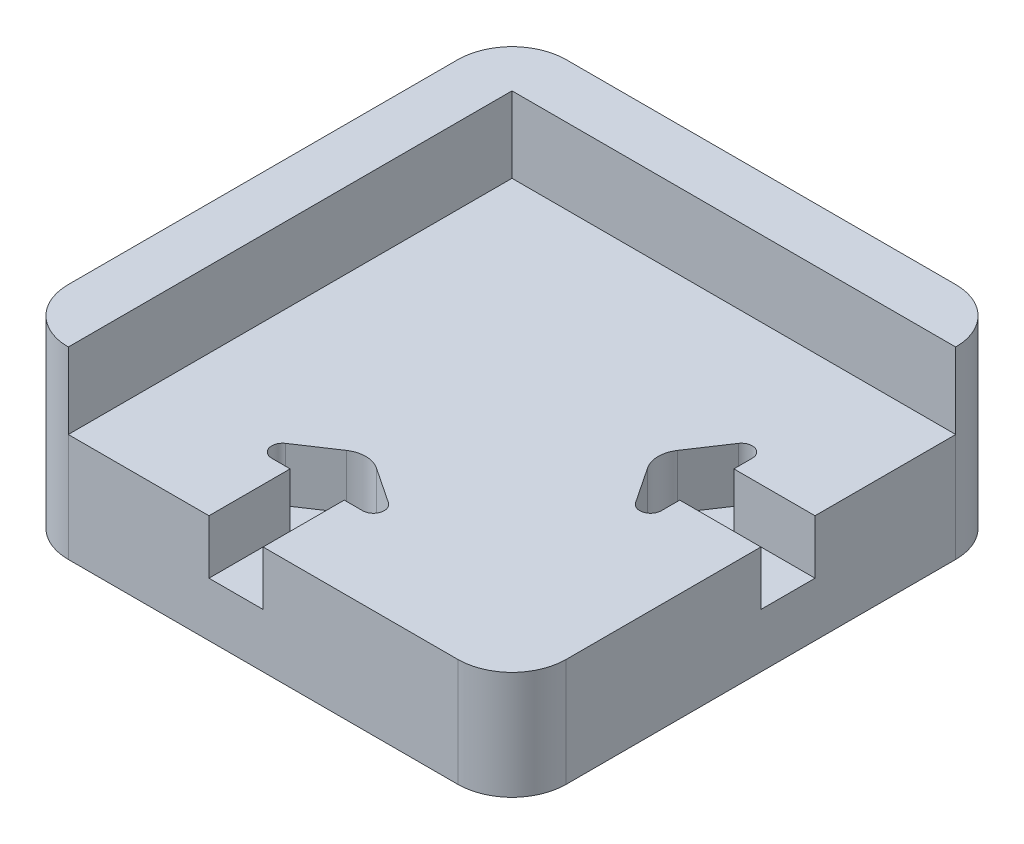
ISO-10303-21;
HEADER;
FILE_DESCRIPTION(('STEP AP214'),'2;1');
FILE_NAME('part.step','',(''),(''),'','','');
FILE_SCHEMA(('AUTOMOTIVE_DESIGN { 1 0 10303 214 1 1 1 1 }'));
ENDSEC;
DATA;
#1=APPLICATION_CONTEXT('core data for automotive mechanical design processes');
#2=APPLICATION_PROTOCOL_DEFINITION('international standard','automotive_design',2000,#1);
#3=PRODUCT_CONTEXT('',#1,'mechanical');
#4=PRODUCT('Part','Part','',(#3));
#5=PRODUCT_RELATED_PRODUCT_CATEGORY('part','',(#4));
#6=PRODUCT_DEFINITION_FORMATION('','',#4);
#7=PRODUCT_DEFINITION_CONTEXT('part definition',#1,'design');
#8=PRODUCT_DEFINITION('design','',#6,#7);
#9=PRODUCT_DEFINITION_SHAPE('','',#8);
#10=(LENGTH_UNIT() NAMED_UNIT(*) SI_UNIT(.MILLI.,.METRE.));
#11=(NAMED_UNIT(*) PLANE_ANGLE_UNIT() SI_UNIT($,.RADIAN.));
#12=(NAMED_UNIT(*) SI_UNIT($,.STERADIAN.) SOLID_ANGLE_UNIT());
#13=UNCERTAINTY_MEASURE_WITH_UNIT(LENGTH_MEASURE(1.E-05),#10,'distance_accuracy_value','');
#14=(GEOMETRIC_REPRESENTATION_CONTEXT(3) GLOBAL_UNCERTAINTY_ASSIGNED_CONTEXT((#13)) GLOBAL_UNIT_ASSIGNED_CONTEXT((#10,
#11,#12)) REPRESENTATION_CONTEXT('',''));
#15=CARTESIAN_POINT('',(0.,0.,0.));
#16=DIRECTION('',(0.,0.,1.));
#17=DIRECTION('',(1.,0.,0.));
#18=AXIS2_PLACEMENT_3D('',#15,#16,#17);
#19=CARTESIAN_POINT('',(56.5334750265675,20.,0.));
#20=DIRECTION('',(1.,0.,0.));
#21=DIRECTION('',(0.,0.,-1.));
#22=AXIS2_PLACEMENT_3D('',#19,#20,#21);
#23=PLANE('',#22);
#24=DIRECTION('',(0.,1.,0.));
#25=VECTOR('',#24,1.);
#26=CARTESIAN_POINT('',(56.5334750265675,10.,16.0010626992561));
#27=LINE('',#26,#25);
#28=CARTESIAN_POINT('',(56.5334750265675,10.,16.0010626992561));
#29=VERTEX_POINT('',#28);
#30=CARTESIAN_POINT('',(56.5334750265675,20.,16.0010626992561));
#31=VERTEX_POINT('',#30);
#32=EDGE_CURVE('E291',#29,#31,#27,.T.);
#33=ORIENTED_EDGE('',*,*,#32,.F.);
#34=DIRECTION('',(0.,0.,-1.));
#35=VECTOR('',#34,1.);
#36=CARTESIAN_POINT('',(56.5334750265675,10.,0.));
#37=LINE('',#36,#35);
#38=CARTESIAN_POINT('',(56.5334750265675,10.,26.0010626992561));
#39=VERTEX_POINT('',#38);
#40=EDGE_CURVE('E246',#39,#29,#37,.T.);
#41=ORIENTED_EDGE('',*,*,#40,.F.);
#42=DIRECTION('',(0.,1.,0.));
#43=VECTOR('',#42,1.);
#44=CARTESIAN_POINT('',(56.5334750265675,10.,26.0010626992561));
#45=LINE('',#44,#43);
#46=CARTESIAN_POINT('',(56.5334750265675,20.,26.0010626992561));
#47=VERTEX_POINT('',#46);
#48=EDGE_CURVE('E241',#39,#47,#45,.T.);
#49=ORIENTED_EDGE('',*,*,#48,.T.);
#50=DIRECTION('',(0.,0.,1.));
#51=VECTOR('',#50,1.);
#52=CARTESIAN_POINT('',(56.5334750265675,20.,0.));
#53=LINE('',#52,#51);
#54=CARTESIAN_POINT('',(56.5334750265675,20.,62.0010626992561));
#55=VERTEX_POINT('',#54);
#56=EDGE_CURVE('E366',#47,#55,#53,.T.);
#57=ORIENTED_EDGE('',*,*,#56,.T.);
#58=DIRECTION('',(0.,-1.,0.));
#59=VECTOR('',#58,1.);
#60=CARTESIAN_POINT('',(56.5334750265675,0.,62.0010626992561));
#61=LINE('',#60,#59);
#62=CARTESIAN_POINT('',(56.5334750265675,0.,62.0010626992561));
#63=VERTEX_POINT('',#62);
#64=EDGE_CURVE('E394',#55,#63,#61,.T.);
#65=ORIENTED_EDGE('',*,*,#64,.T.);
#66=DIRECTION('',(0.,0.,1.));
#67=VECTOR('',#66,1.);
#68=CARTESIAN_POINT('',(56.5334750265675,0.,0.));
#69=LINE('',#68,#67);
#70=CARTESIAN_POINT('',(56.5334750265675,0.,-9.99893730074389));
#71=VERTEX_POINT('',#70);
#72=EDGE_CURVE('E361',#71,#63,#69,.T.);
#73=ORIENTED_EDGE('',*,*,#72,.F.);
#74=DIRECTION('',(0.,-1.,0.));
#75=VECTOR('',#74,1.);
#76=CARTESIAN_POINT('',(56.5334750265675,20.,-9.99893730074389));
#77=LINE('',#76,#75);
#78=CARTESIAN_POINT('',(56.5334750265675,20.,-9.99893730074389));
#79=VERTEX_POINT('',#78);
#80=EDGE_CURVE('E397',#71,#79,#77,.F.);
#81=ORIENTED_EDGE('',*,*,#80,.T.);
#82=EDGE_CURVE('E362',#79,#31,#53,.T.);
#83=ORIENTED_EDGE('',*,*,#82,.T.);
#84=EDGE_LOOP('',(#33,#41,#49,#57,#65,#73,#81,#83));
#85=FACE_BOUND('',#84,.T.);
#86=ADVANCED_FACE('F41',(#85),#23,.T.);
#87=CARTESIAN_POINT('',(0.,20.,-19.9989373007439));
#88=DIRECTION('',(0.,0.,-1.));
#89=DIRECTION('',(-1.,0.,0.));
#90=AXIS2_PLACEMENT_3D('',#87,#88,#89);
#91=PLANE('',#90);
#92=DIRECTION('',(1.,0.,0.));
#93=VECTOR('',#92,1.);
#94=CARTESIAN_POINT('',(0.,34.,-19.9989373007439));
#95=LINE('',#94,#93);
#96=CARTESIAN_POINT('',(-25.4665249734325,34.,-19.9989373007439));
#97=VERTEX_POINT('',#96);
#98=CARTESIAN_POINT('',(46.5334750265675,34.,-19.9989373007439));
#99=VERTEX_POINT('',#98);
#100=EDGE_CURVE('E341',#97,#99,#95,.T.);
#101=ORIENTED_EDGE('',*,*,#100,.T.);
#102=DIRECTION('',(0.,-1.,0.));
#103=VECTOR('',#102,1.);
#104=CARTESIAN_POINT('',(46.5334750265675,20.,-19.9989373007439));
#105=LINE('',#104,#103);
#106=CARTESIAN_POINT('',(46.5334750265675,0.,-19.9989373007439));
#107=VERTEX_POINT('',#106);
#108=EDGE_CURVE('E383',#99,#107,#105,.T.);
#109=ORIENTED_EDGE('',*,*,#108,.T.);
#110=DIRECTION('',(1.,0.,0.));
#111=VECTOR('',#110,1.);
#112=CARTESIAN_POINT('',(0.,0.,-19.9989373007439));
#113=LINE('',#112,#111);
#114=CARTESIAN_POINT('',(-25.4665249734325,0.,-19.9989373007439));
#115=VERTEX_POINT('',#114);
#116=EDGE_CURVE('E373',#115,#107,#113,.T.);
#117=ORIENTED_EDGE('',*,*,#116,.F.);
#118=DIRECTION('',(0.,-1.,0.));
#119=VECTOR('',#118,1.);
#120=CARTESIAN_POINT('',(-25.4665249734325,34.,-19.9989373007439));
#121=LINE('',#120,#119);
#122=EDGE_CURVE('E370',#115,#97,#121,.F.);
#123=ORIENTED_EDGE('',*,*,#122,.T.);
#124=EDGE_LOOP('',(#101,#109,#117,#123));
#125=FACE_BOUND('',#124,.T.);
#126=ADVANCED_FACE('F559',(#125),#91,.T.);
#127=CARTESIAN_POINT('',(-35.4665249734325,20.,0.));
#128=DIRECTION('',(1.,0.,0.));
#129=DIRECTION('',(0.,0.,-1.));
#130=AXIS2_PLACEMENT_3D('',#127,#128,#129);
#131=PLANE('',#130);
#132=DIRECTION('',(0.,0.,1.));
#133=VECTOR('',#132,1.);
#134=CARTESIAN_POINT('',(-35.4665249734325,34.,0.));
#135=LINE('',#134,#133);
#136=CARTESIAN_POINT('',(-35.4665249734325,34.,-9.99893730074389));
#137=VERTEX_POINT('',#136);
#138=CARTESIAN_POINT('',(-35.4665249734325,34.,62.0010626992561));
#139=VERTEX_POINT('',#138);
#140=EDGE_CURVE('E344',#137,#139,#135,.T.);
#141=ORIENTED_EDGE('',*,*,#140,.F.);
#142=DIRECTION('',(0.,-1.,0.));
#143=VECTOR('',#142,1.);
#144=CARTESIAN_POINT('',(-35.4665249734325,0.,-9.99893730074389));
#145=LINE('',#144,#143);
#146=CARTESIAN_POINT('',(-35.4665249734325,0.,-9.99893730074389));
#147=VERTEX_POINT('',#146);
#148=EDGE_CURVE('E407',#137,#147,#145,.T.);
#149=ORIENTED_EDGE('',*,*,#148,.T.);
#150=DIRECTION('',(0.,0.,1.));
#151=VECTOR('',#150,1.);
#152=CARTESIAN_POINT('',(-35.4665249734325,0.,0.));
#153=LINE('',#152,#151);
#154=CARTESIAN_POINT('',(-35.4665249734325,0.,62.0010626992561));
#155=VERTEX_POINT('',#154);
#156=EDGE_CURVE('E376',#147,#155,#153,.T.);
#157=ORIENTED_EDGE('',*,*,#156,.T.);
#158=DIRECTION('',(0.,-1.,0.));
#159=VECTOR('',#158,1.);
#160=CARTESIAN_POINT('',(-35.4665249734325,20.,62.0010626992561));
#161=LINE('',#160,#159);
#162=EDGE_CURVE('E405',#155,#139,#161,.F.);
#163=ORIENTED_EDGE('',*,*,#162,.T.);
#164=EDGE_LOOP('',(#141,#149,#157,#163));
#165=FACE_BOUND('',#164,.T.);
#166=ADVANCED_FACE('F566',(#165),#131,.F.);
#167=CARTESIAN_POINT('',(0.,20.,72.0010626992561));
#168=DIRECTION('',(0.,0.,-1.));
#169=DIRECTION('',(-1.,0.,0.));
#170=AXIS2_PLACEMENT_3D('',#167,#168,#169);
#171=PLANE('',#170);
#172=DIRECTION('',(1.,0.,0.));
#173=VECTOR('',#172,1.);
#174=CARTESIAN_POINT('',(0.,20.,72.0010626992561));
#175=LINE('',#174,#173);
#176=CARTESIAN_POINT('',(10.5334750265675,20.,72.0010626992561));
#177=VERTEX_POINT('',#176);
#178=CARTESIAN_POINT('',(46.5334750265675,20.,72.0010626992561));
#179=VERTEX_POINT('',#178);
#180=EDGE_CURVE('E365',#177,#179,#175,.T.);
#181=ORIENTED_EDGE('',*,*,#180,.F.);
#182=DIRECTION('',(0.,1.,0.));
#183=VECTOR('',#182,1.);
#184=CARTESIAN_POINT('',(10.5334750265675,10.,72.0010626992561));
#185=LINE('',#184,#183);
#186=CARTESIAN_POINT('',(10.5334750265675,10.,72.0010626992561));
#187=VERTEX_POINT('',#186);
#188=EDGE_CURVE('E330',#187,#177,#185,.T.);
#189=ORIENTED_EDGE('',*,*,#188,.F.);
#190=DIRECTION('',(1.,0.,0.));
#191=VECTOR('',#190,1.);
#192=CARTESIAN_POINT('',(0.,10.,72.0010626992561));
#193=LINE('',#192,#191);
#194=CARTESIAN_POINT('',(0.533475026567498,10.,72.0010626992561));
#195=VERTEX_POINT('',#194);
#196=EDGE_CURVE('E300',#195,#187,#193,.T.);
#197=ORIENTED_EDGE('',*,*,#196,.F.);
#198=DIRECTION('',(0.,1.,0.));
#199=VECTOR('',#198,1.);
#200=CARTESIAN_POINT('',(0.533475026567498,10.,72.0010626992561));
#201=LINE('',#200,#199);
#202=CARTESIAN_POINT('',(0.533475026567498,20.,72.0010626992561));
#203=VERTEX_POINT('',#202);
#204=EDGE_CURVE('E332',#195,#203,#201,.T.);
#205=ORIENTED_EDGE('',*,*,#204,.T.);
#206=CARTESIAN_POINT('',(-25.4665249734325,20.,72.0010626992561));
#207=VERTEX_POINT('',#206);
#208=EDGE_CURVE('E367',#207,#203,#175,.T.);
#209=ORIENTED_EDGE('',*,*,#208,.F.);
#210=DIRECTION('',(0.,-1.,0.));
#211=VECTOR('',#210,1.);
#212=CARTESIAN_POINT('',(-25.4665249734325,20.,72.0010626992561));
#213=LINE('',#212,#211);
#214=CARTESIAN_POINT('',(-25.4665249734325,0.,72.0010626992561));
#215=VERTEX_POINT('',#214);
#216=EDGE_CURVE('E413',#207,#215,#213,.T.);
#217=ORIENTED_EDGE('',*,*,#216,.T.);
#218=DIRECTION('',(1.,0.,0.));
#219=VECTOR('',#218,1.);
#220=CARTESIAN_POINT('',(0.,0.,72.0010626992561));
#221=LINE('',#220,#219);
#222=CARTESIAN_POINT('',(46.5334750265675,0.,72.0010626992561));
#223=VERTEX_POINT('',#222);
#224=EDGE_CURVE('E379',#215,#223,#221,.T.);
#225=ORIENTED_EDGE('',*,*,#224,.T.);
#226=DIRECTION('',(0.,-1.,0.));
#227=VECTOR('',#226,1.);
#228=CARTESIAN_POINT('',(46.5334750265675,20.,72.0010626992561));
#229=LINE('',#228,#227);
#230=EDGE_CURVE('E410',#223,#179,#229,.F.);
#231=ORIENTED_EDGE('',*,*,#230,.T.);
#232=EDGE_LOOP('',(#181,#189,#197,#205,#209,#217,#225,#231));
#233=FACE_BOUND('',#232,.T.);
#234=ADVANCED_FACE('F509',(#233),#171,.F.);
#235=CARTESIAN_POINT('',(0.,20.,0.));
#236=DIRECTION('',(0.,1.,0.));
#237=DIRECTION('',(0.,0.,1.));
#238=AXIS2_PLACEMENT_3D('',#235,#236,#237);
#239=PLANE('',#238);
#240=DIRECTION('',(-1.,0.,0.));
#241=VECTOR('',#240,1.);
#242=CARTESIAN_POINT('',(0.,20.,16.0010626992561));
#243=LINE('',#242,#241);
#244=CARTESIAN_POINT('',(41.5334750265675,20.,16.0010626992561));
#245=VERTEX_POINT('',#244);
#246=EDGE_CURVE('E282',#31,#245,#243,.T.);
#247=ORIENTED_EDGE('',*,*,#246,.F.);
#248=ORIENTED_EDGE('',*,*,#82,.F.);
#249=DIRECTION('',(-1.,0.,0.));
#250=VECTOR('',#249,1.);
#251=CARTESIAN_POINT('',(0.,20.,-9.99893730074389));
#252=LINE('',#251,#250);
#253=CARTESIAN_POINT('',(-25.4665249734325,20.,-9.99893730074389));
#254=VERTEX_POINT('',#253);
#255=EDGE_CURVE('E356',#79,#254,#252,.T.);
#256=ORIENTED_EDGE('',*,*,#255,.T.);
#257=DIRECTION('',(0.,0.,-1.));
#258=VECTOR('',#257,1.);
#259=CARTESIAN_POINT('',(-25.4665249734325,20.,0.));
#260=LINE('',#259,#258);
#261=EDGE_CURVE('E358',#207,#254,#260,.T.);
#262=ORIENTED_EDGE('',*,*,#261,.F.);
#263=ORIENTED_EDGE('',*,*,#208,.T.);
#264=DIRECTION('',(0.,0.,-1.));
#265=VECTOR('',#264,1.);
#266=CARTESIAN_POINT('',(0.533475026567498,20.,0.));
#267=LINE('',#266,#265);
#268=CARTESIAN_POINT('',(0.533475026567498,20.,57.0010626992561));
#269=VERTEX_POINT('',#268);
#270=EDGE_CURVE('E315',#203,#269,#267,.T.);
#271=ORIENTED_EDGE('',*,*,#270,.T.);
#272=DIRECTION('',(-1.,0.,0.));
#273=VECTOR('',#272,1.);
#274=CARTESIAN_POINT('',(0.,20.,57.0010626992561));
#275=LINE('',#274,#273);
#276=CARTESIAN_POINT('',(-2.86097369796851,20.,57.0010626992561));
#277=VERTEX_POINT('',#276);
#278=EDGE_CURVE('E290',#269,#277,#275,.T.);
#279=ORIENTED_EDGE('',*,*,#278,.T.);
#280=CARTESIAN_POINT('',(-2.86097369796851,20.,55.0010626992561));
#281=DIRECTION('',(0.,1.,0.));
#282=DIRECTION('',(0.,0.,1.));
#283=AXIS2_PLACEMENT_3D('',#280,#281,#282);
#284=CIRCLE('',#283,2.);
#285=CARTESIAN_POINT('',(-3.97037409041897,20.,53.3369621105804));
#286=VERTEX_POINT('',#285);
#287=EDGE_CURVE('E11',#277,#286,#284,.F.);
#288=ORIENTED_EDGE('',*,*,#287,.T.);
#289=DIRECTION('',(0.832050294337844,0.,-0.554700196225229));
#290=VECTOR('',#289,1.);
#291=CARTESIAN_POINT('',(23.3954058693697,20.,35.0931088040546));
#292=LINE('',#291,#290);
#293=CARTESIAN_POINT('',(2.75984436673248,20.,48.8501498058128));
#294=VERTEX_POINT('',#293);
#295=EDGE_CURVE('E298',#286,#294,#292,.T.);
#296=ORIENTED_EDGE('',*,*,#295,.T.);
#297=CARTESIAN_POINT('',(5.53334534785862,20.,53.010401277502));
#298=DIRECTION('',(0.,1.,0.));
#299=DIRECTION('',(0.,0.,1.));
#300=AXIS2_PLACEMENT_3D('',#297,#298,#299);
#301=CIRCLE('',#300,5.);
#302=CARTESIAN_POINT('',(8.3070258789538,20.,48.8502695113889));
#303=VERTEX_POINT('',#302);
#304=EDGE_CURVE('E439',#294,#303,#301,.F.);
#305=ORIENTED_EDGE('',*,*,#304,.T.);
#306=DIRECTION('',(-0.832026353222626,0.,-0.554736106219036));
#307=VECTOR('',#306,1.);
#308=CARTESIAN_POINT('',(-19.990750135459,20.,29.9833213431095));
#309=LINE('',#308,#307);
#310=CARTESIAN_POINT('',(15.0365073004134,20.,53.3370099928109));
#311=VERTEX_POINT('',#310);
#312=EDGE_CURVE('E324',#311,#303,#309,.T.);
#313=ORIENTED_EDGE('',*,*,#312,.F.);
#314=CARTESIAN_POINT('',(13.9270350879754,20.,55.0010626992561));
#315=DIRECTION('',(0.,1.,0.));
#316=DIRECTION('',(0.,0.,1.));
#317=AXIS2_PLACEMENT_3D('',#314,#315,#316);
#318=CIRCLE('',#317,2.);
#319=CARTESIAN_POINT('',(13.9270350879754,20.,57.0010626992561));
#320=VERTEX_POINT('',#319);
#321=EDGE_CURVE('E49',#311,#320,#318,.F.);
#322=ORIENTED_EDGE('',*,*,#321,.T.);
#323=DIRECTION('',(1.,0.,0.));
#324=VECTOR('',#323,1.);
#325=CARTESIAN_POINT('',(0.,20.,57.0010626992561));
#326=LINE('',#325,#324);
#327=CARTESIAN_POINT('',(10.5334750265675,20.,57.0010626992561));
#328=VERTEX_POINT('',#327);
#329=EDGE_CURVE('E321',#328,#320,#326,.T.);
#330=ORIENTED_EDGE('',*,*,#329,.F.);
#331=DIRECTION('',(0.,0.,-1.));
#332=VECTOR('',#331,1.);
#333=CARTESIAN_POINT('',(10.5334750265675,20.,0.));
#334=LINE('',#333,#332);
#335=EDGE_CURVE('E318',#177,#328,#334,.T.);
#336=ORIENTED_EDGE('',*,*,#335,.F.);
#337=ORIENTED_EDGE('',*,*,#180,.T.);
#338=CARTESIAN_POINT('',(46.5334750265675,20.,62.0010626992561));
#339=DIRECTION('',(0.,1.,0.));
#340=DIRECTION('',(0.,0.,1.));
#341=AXIS2_PLACEMENT_3D('',#338,#339,#340);
#342=CIRCLE('',#341,10.);
#343=EDGE_CURVE('E415',#179,#55,#342,.T.);
#344=ORIENTED_EDGE('',*,*,#343,.T.);
#345=ORIENTED_EDGE('',*,*,#56,.F.);
#346=DIRECTION('',(-1.,0.,0.));
#347=VECTOR('',#346,1.);
#348=CARTESIAN_POINT('',(0.,20.,26.0010626992561));
#349=LINE('',#348,#347);
#350=CARTESIAN_POINT('',(41.5334750265675,20.,26.0010626992561));
#351=VERTEX_POINT('',#350);
#352=EDGE_CURVE('E280',#47,#351,#349,.T.);
#353=ORIENTED_EDGE('',*,*,#352,.T.);
#354=DIRECTION('',(0.,0.,1.));
#355=VECTOR('',#354,1.);
#356=CARTESIAN_POINT('',(41.5334750265675,20.,0.));
#357=LINE('',#356,#355);
#358=CARTESIAN_POINT('',(41.5334750265675,20.,29.3955114237921));
#359=VERTEX_POINT('',#358);
#360=EDGE_CURVE('E255',#351,#359,#357,.T.);
#361=ORIENTED_EDGE('',*,*,#360,.T.);
#362=CARTESIAN_POINT('',(39.5334750265675,20.,29.3955114237921));
#363=DIRECTION('',(0.,1.,0.));
#364=DIRECTION('',(0.,0.,1.));
#365=AXIS2_PLACEMENT_3D('',#362,#363,#364);
#366=CIRCLE('',#365,2.);
#367=CARTESIAN_POINT('',(37.8693744378918,20.,30.5049118162426));
#368=VERTEX_POINT('',#367);
#369=EDGE_CURVE('E469',#359,#368,#366,.F.);
#370=ORIENTED_EDGE('',*,*,#369,.T.);
#371=DIRECTION('',(-0.554700196225229,0.,-0.832050294337844));
#372=VECTOR('',#371,1.);
#373=CARTESIAN_POINT('',(12.1380691571978,20.,-8.0920461047985));
#374=LINE('',#373,#372);
#375=CARTESIAN_POINT('',(33.3824756806516,20.,23.7745636803823));
#376=VERTEX_POINT('',#375);
#377=EDGE_CURVE('E277',#368,#376,#374,.T.);
#378=ORIENTED_EDGE('',*,*,#377,.T.);
#379=CARTESIAN_POINT('',(37.5427271523408,20.,21.0010626992561));
#380=DIRECTION('',(0.,1.,0.));
#381=DIRECTION('',(0.,0.,1.));
#382=AXIS2_PLACEMENT_3D('',#379,#380,#381);
#383=CIRCLE('',#382,5.);
#384=CARTESIAN_POINT('',(33.3824756806516,20.,18.22756171813));
#385=VERTEX_POINT('',#384);
#386=EDGE_CURVE('E436',#376,#385,#383,.F.);
#387=ORIENTED_EDGE('',*,*,#386,.T.);
#388=DIRECTION('',(-0.554700196225229,0.,0.832050294337844));
#389=VECTOR('',#388,1.);
#390=CARTESIAN_POINT('',(31.5236654949726,20.,21.0157769966484));
#391=LINE('',#390,#389);
#392=CARTESIAN_POINT('',(37.8693744378918,20.,11.4972135822696));
#393=VERTEX_POINT('',#392);
#394=EDGE_CURVE('E275',#393,#385,#391,.T.);
#395=ORIENTED_EDGE('',*,*,#394,.F.);
#396=CARTESIAN_POINT('',(39.5334750265675,20.,12.6066139747201));
#397=DIRECTION('',(0.,1.,0.));
#398=DIRECTION('',(0.,0.,1.));
#399=AXIS2_PLACEMENT_3D('',#396,#397,#398);
#400=CIRCLE('',#399,2.);
#401=CARTESIAN_POINT('',(41.5334750265675,20.,12.6066139747201));
#402=VERTEX_POINT('',#401);
#403=EDGE_CURVE('E467',#393,#402,#400,.F.);
#404=ORIENTED_EDGE('',*,*,#403,.T.);
#405=DIRECTION('',(0.,0.,-1.));
#406=VECTOR('',#405,1.);
#407=CARTESIAN_POINT('',(41.5334750265675,20.,0.));
#408=LINE('',#407,#406);
#409=EDGE_CURVE('E285',#245,#402,#408,.T.);
#410=ORIENTED_EDGE('',*,*,#409,.F.);
#411=EDGE_LOOP('',(#247,#248,#256,#262,#263,#271,#279,#288,#296,#305,#313,#322,#330,#336,#337,
#344,#345,#353,#361,#370,#378,#387,#395,#404,#410));
#412=FACE_BOUND('',#411,.T.);
#413=ADVANCED_FACE('F473',(#412),#239,.T.);
#414=CARTESIAN_POINT('',(0.,0.,0.));
#415=DIRECTION('',(0.,1.,0.));
#416=DIRECTION('',(0.,0.,1.));
#417=AXIS2_PLACEMENT_3D('',#414,#415,#416);
#418=PLANE('',#417);
#419=ORIENTED_EDGE('',*,*,#116,.T.);
#420=CARTESIAN_POINT('',(46.5334750265675,0.,-9.99893730074389));
#421=DIRECTION('',(0.,1.,0.));
#422=DIRECTION('',(0.,0.,1.));
#423=AXIS2_PLACEMENT_3D('',#420,#421,#422);
#424=CIRCLE('',#423,10.);
#425=EDGE_CURVE('E392',#107,#71,#424,.F.);
#426=ORIENTED_EDGE('',*,*,#425,.T.);
#427=ORIENTED_EDGE('',*,*,#72,.T.);
#428=CARTESIAN_POINT('',(46.5334750265675,0.,62.0010626992561));
#429=DIRECTION('',(0.,1.,0.));
#430=DIRECTION('',(0.,0.,1.));
#431=AXIS2_PLACEMENT_3D('',#428,#429,#430);
#432=CIRCLE('',#431,10.);
#433=EDGE_CURVE('E386',#63,#223,#432,.F.);
#434=ORIENTED_EDGE('',*,*,#433,.T.);
#435=ORIENTED_EDGE('',*,*,#224,.F.);
#436=CARTESIAN_POINT('',(-25.4665249734325,0.,62.0010626992561));
#437=DIRECTION('',(0.,1.,0.));
#438=DIRECTION('',(0.,0.,1.));
#439=AXIS2_PLACEMENT_3D('',#436,#437,#438);
#440=CIRCLE('',#439,10.);
#441=EDGE_CURVE('E388',#215,#155,#440,.F.);
#442=ORIENTED_EDGE('',*,*,#441,.T.);
#443=ORIENTED_EDGE('',*,*,#156,.F.);
#444=CARTESIAN_POINT('',(-25.4665249734325,0.,-9.99893730074389));
#445=DIRECTION('',(0.,1.,0.));
#446=DIRECTION('',(0.,0.,1.));
#447=AXIS2_PLACEMENT_3D('',#444,#445,#446);
#448=CIRCLE('',#447,10.);
#449=EDGE_CURVE('E390',#147,#115,#448,.F.);
#450=ORIENTED_EDGE('',*,*,#449,.T.);
#451=EDGE_LOOP('',(#419,#426,#427,#434,#435,#442,#443,#450));
#452=FACE_BOUND('',#451,.T.);
#453=ADVANCED_FACE('F712',(#452),#418,.F.);
#454=CARTESIAN_POINT('',(-25.4665249734325,34.,0.));
#455=DIRECTION('',(1.,0.,0.));
#456=DIRECTION('',(0.,0.,-1.));
#457=AXIS2_PLACEMENT_3D('',#454,#455,#456);
#458=PLANE('',#457);
#459=DIRECTION('',(0.,-1.,0.));
#460=VECTOR('',#459,1.);
#461=CARTESIAN_POINT('',(-25.4665249734325,34.,72.0010626992561));
#462=LINE('',#461,#460);
#463=CARTESIAN_POINT('',(-25.4665249734325,34.,72.0010626992561));
#464=VERTEX_POINT('',#463);
#465=EDGE_CURVE('E347',#464,#207,#462,.T.);
#466=ORIENTED_EDGE('',*,*,#465,.T.);
#467=ORIENTED_EDGE('',*,*,#261,.T.);
#468=DIRECTION('',(0.,-1.,0.));
#469=VECTOR('',#468,1.);
#470=CARTESIAN_POINT('',(-25.4665249734325,34.,-9.99893730074389));
#471=LINE('',#470,#469);
#472=CARTESIAN_POINT('',(-25.4665249734325,34.,-9.99893730074389));
#473=VERTEX_POINT('',#472);
#474=EDGE_CURVE('E353',#473,#254,#471,.T.);
#475=ORIENTED_EDGE('',*,*,#474,.F.);
#476=DIRECTION('',(0.,0.,1.));
#477=VECTOR('',#476,1.);
#478=CARTESIAN_POINT('',(-25.4665249734325,34.,0.));
#479=LINE('',#478,#477);
#480=EDGE_CURVE('E329',#473,#464,#479,.T.);
#481=ORIENTED_EDGE('',*,*,#480,.T.);
#482=EDGE_LOOP('',(#466,#467,#475,#481));
#483=FACE_BOUND('',#482,.T.);
#484=ADVANCED_FACE('F726',(#483),#458,.T.);
#485=CARTESIAN_POINT('',(0.,34.,-9.99893730074389));
#486=DIRECTION('',(0.,0.,-1.));
#487=DIRECTION('',(-1.,0.,0.));
#488=AXIS2_PLACEMENT_3D('',#485,#486,#487);
#489=PLANE('',#488);
#490=ORIENTED_EDGE('',*,*,#255,.F.);
#491=DIRECTION('',(0.,-1.,0.));
#492=VECTOR('',#491,1.);
#493=CARTESIAN_POINT('',(56.5334750265675,34.,-9.99893730074389));
#494=LINE('',#493,#492);
#495=CARTESIAN_POINT('',(56.5334750265675,34.,-9.99893730074389));
#496=VERTEX_POINT('',#495);
#497=EDGE_CURVE('E350',#496,#79,#494,.T.);
#498=ORIENTED_EDGE('',*,*,#497,.F.);
#499=DIRECTION('',(1.,0.,0.));
#500=VECTOR('',#499,1.);
#501=CARTESIAN_POINT('',(0.,34.,-9.99893730074389));
#502=LINE('',#501,#500);
#503=EDGE_CURVE('E339',#473,#496,#502,.T.);
#504=ORIENTED_EDGE('',*,*,#503,.F.);
#505=ORIENTED_EDGE('',*,*,#474,.T.);
#506=EDGE_LOOP('',(#490,#498,#504,#505));
#507=FACE_BOUND('',#506,.T.);
#508=ADVANCED_FACE('F802',(#507),#489,.F.);
#509=CARTESIAN_POINT('',(0.,34.,0.));
#510=DIRECTION('',(0.,1.,0.));
#511=DIRECTION('',(0.,0.,1.));
#512=AXIS2_PLACEMENT_3D('',#509,#510,#511);
#513=PLANE('',#512);
#514=ORIENTED_EDGE('',*,*,#503,.T.);
#515=CARTESIAN_POINT('',(46.5334750265675,34.,-9.99893730074389));
#516=DIRECTION('',(0.,1.,0.));
#517=DIRECTION('',(0.,0.,1.));
#518=AXIS2_PLACEMENT_3D('',#515,#516,#517);
#519=CIRCLE('',#518,10.);
#520=EDGE_CURVE('E403',#496,#99,#519,.T.);
#521=ORIENTED_EDGE('',*,*,#520,.T.);
#522=ORIENTED_EDGE('',*,*,#100,.F.);
#523=CARTESIAN_POINT('',(-25.4665249734325,34.,-9.99893730074389));
#524=DIRECTION('',(0.,1.,0.));
#525=DIRECTION('',(0.,0.,1.));
#526=AXIS2_PLACEMENT_3D('',#523,#524,#525);
#527=CIRCLE('',#526,10.);
#528=EDGE_CURVE('E401',#97,#137,#527,.T.);
#529=ORIENTED_EDGE('',*,*,#528,.T.);
#530=ORIENTED_EDGE('',*,*,#140,.T.);
#531=CARTESIAN_POINT('',(-25.4665249734325,34.,62.0010626992561));
#532=DIRECTION('',(0.,1.,0.));
#533=DIRECTION('',(0.,0.,1.));
#534=AXIS2_PLACEMENT_3D('',#531,#532,#533);
#535=CIRCLE('',#534,10.);
#536=EDGE_CURVE('E399',#139,#464,#535,.T.);
#537=ORIENTED_EDGE('',*,*,#536,.T.);
#538=ORIENTED_EDGE('',*,*,#480,.F.);
#539=EDGE_LOOP('',(#514,#521,#522,#529,#530,#537,#538));
#540=FACE_BOUND('',#539,.T.);
#541=ADVANCED_FACE('F575',(#540),#513,.T.);
#542=CARTESIAN_POINT('',(46.5334750265675,20.,-9.99893730074389));
#543=DIRECTION('',(0.,-1.,0.));
#544=DIRECTION('',(0.,0.,-1.));
#545=AXIS2_PLACEMENT_3D('',#542,#543,#544);
#546=CYLINDRICAL_SURFACE('',#545,10.);
#547=ORIENTED_EDGE('',*,*,#497,.T.);
#548=ORIENTED_EDGE('',*,*,#80,.F.);
#549=ORIENTED_EDGE('',*,*,#425,.F.);
#550=ORIENTED_EDGE('',*,*,#108,.F.);
#551=ORIENTED_EDGE('',*,*,#520,.F.);
#552=EDGE_LOOP('',(#547,#548,#549,#550,#551));
#553=FACE_BOUND('',#552,.T.);
#554=ADVANCED_FACE('F571',(#553),#546,.T.);
#555=CARTESIAN_POINT('',(-25.4665249734325,20.,-9.99893730074389));
#556=DIRECTION('',(0.,1.,0.));
#557=DIRECTION('',(0.,0.,1.));
#558=AXIS2_PLACEMENT_3D('',#555,#556,#557);
#559=CYLINDRICAL_SURFACE('',#558,10.);
#560=ORIENTED_EDGE('',*,*,#528,.F.);
#561=ORIENTED_EDGE('',*,*,#122,.F.);
#562=ORIENTED_EDGE('',*,*,#449,.F.);
#563=ORIENTED_EDGE('',*,*,#148,.F.);
#564=EDGE_LOOP('',(#560,#561,#562,#563));
#565=FACE_BOUND('',#564,.T.);
#566=ADVANCED_FACE('F574',(#565),#559,.T.);
#567=CARTESIAN_POINT('',(-25.4665249734325,20.,62.0010626992561));
#568=DIRECTION('',(0.,-1.,0.));
#569=DIRECTION('',(0.,0.,-1.));
#570=AXIS2_PLACEMENT_3D('',#567,#568,#569);
#571=CYLINDRICAL_SURFACE('',#570,10.);
#572=ORIENTED_EDGE('',*,*,#536,.F.);
#573=ORIENTED_EDGE('',*,*,#162,.F.);
#574=ORIENTED_EDGE('',*,*,#441,.F.);
#575=ORIENTED_EDGE('',*,*,#216,.F.);
#576=ORIENTED_EDGE('',*,*,#465,.F.);
#577=EDGE_LOOP('',(#572,#573,#574,#575,#576));
#578=FACE_BOUND('',#577,.T.);
#579=ADVANCED_FACE('F579',(#578),#571,.T.);
#580=CARTESIAN_POINT('',(46.5334750265675,20.,62.0010626992561));
#581=DIRECTION('',(0.,1.,0.));
#582=DIRECTION('',(0.,0.,1.));
#583=AXIS2_PLACEMENT_3D('',#580,#581,#582);
#584=CYLINDRICAL_SURFACE('',#583,10.);
#585=ORIENTED_EDGE('',*,*,#343,.F.);
#586=ORIENTED_EDGE('',*,*,#230,.F.);
#587=ORIENTED_EDGE('',*,*,#433,.F.);
#588=ORIENTED_EDGE('',*,*,#64,.F.);
#589=EDGE_LOOP('',(#585,#586,#587,#588));
#590=FACE_BOUND('',#589,.T.);
#591=ADVANCED_FACE('F518',(#590),#584,.T.);
#592=CARTESIAN_POINT('',(0.,10.,57.0010626992561));
#593=DIRECTION('',(0.,0.,-1.));
#594=DIRECTION('',(-1.,0.,0.));
#595=AXIS2_PLACEMENT_3D('',#592,#593,#594);
#596=PLANE('',#595);
#597=DIRECTION('',(-1.,0.,0.));
#598=VECTOR('',#597,1.);
#599=CARTESIAN_POINT('',(0.,10.,57.0010626992561));
#600=LINE('',#599,#598);
#601=CARTESIAN_POINT('',(0.533475026567498,10.,57.0010626992561));
#602=VERTEX_POINT('',#601);
#603=CARTESIAN_POINT('',(-2.86097369796851,10.,57.0010626992561));
#604=VERTEX_POINT('',#603);
#605=EDGE_CURVE('E294',#602,#604,#600,.T.);
#606=ORIENTED_EDGE('',*,*,#605,.T.);
#607=DIRECTION('',(0.,1.,0.));
#608=VECTOR('',#607,1.);
#609=CARTESIAN_POINT('',(-2.86097369796851,20.,57.0010626992561));
#610=LINE('',#609,#608);
#611=EDGE_CURVE('E463',#604,#277,#610,.T.);
#612=ORIENTED_EDGE('',*,*,#611,.T.);
#613=ORIENTED_EDGE('',*,*,#278,.F.);
#614=DIRECTION('',(0.,1.,0.));
#615=VECTOR('',#614,1.);
#616=CARTESIAN_POINT('',(0.533475026567498,10.,57.0010626992561));
#617=LINE('',#616,#615);
#618=EDGE_CURVE('E313',#602,#269,#617,.T.);
#619=ORIENTED_EDGE('',*,*,#618,.F.);
#620=EDGE_LOOP('',(#606,#612,#613,#619));
#621=FACE_BOUND('',#620,.T.);
#622=ADVANCED_FACE('F499',(#621),#596,.T.);
#623=CARTESIAN_POINT('',(23.3954058693697,10.,35.0931088040546));
#624=DIRECTION('',(0.554700196225229,0.,0.832050294337844));
#625=DIRECTION('',(0.832050294337844,0.,-0.554700196225229));
#626=AXIS2_PLACEMENT_3D('',#623,#624,#625);
#627=PLANE('',#626);
#628=ORIENTED_EDGE('',*,*,#295,.F.);
#629=DIRECTION('',(0.,1.,0.));
#630=VECTOR('',#629,1.);
#631=CARTESIAN_POINT('',(-3.97037409041897,10.,53.3369621105804));
#632=LINE('',#631,#630);
#633=CARTESIAN_POINT('',(-3.97037409041897,10.,53.3369621105804));
#634=VERTEX_POINT('',#633);
#635=EDGE_CURVE('E465',#286,#634,#632,.F.);
#636=ORIENTED_EDGE('',*,*,#635,.T.);
#637=DIRECTION('',(0.832050294337844,0.,-0.554700196225229));
#638=VECTOR('',#637,1.);
#639=CARTESIAN_POINT('',(23.3954058693697,10.,35.0931088040546));
#640=LINE('',#639,#638);
#641=CARTESIAN_POINT('',(2.75984436673248,10.,48.8501498058128));
#642=VERTEX_POINT('',#641);
#643=EDGE_CURVE('E311',#634,#642,#640,.T.);
#644=ORIENTED_EDGE('',*,*,#643,.T.);
#645=DIRECTION('',(0.,1.,0.));
#646=VECTOR('',#645,1.);
#647=CARTESIAN_POINT('',(2.75984436673247,10.,48.8501498058128));
#648=LINE('',#647,#646);
#649=EDGE_CURVE('E427',#642,#294,#648,.T.);
#650=ORIENTED_EDGE('',*,*,#649,.T.);
#651=EDGE_LOOP('',(#628,#636,#644,#650));
#652=FACE_BOUND('',#651,.T.);
#653=ADVANCED_FACE('F692',(#652),#627,.T.);
#654=CARTESIAN_POINT('',(-19.990750135459,10.,29.9833213431095));
#655=DIRECTION('',(0.554736106219036,0.,-0.832026353222626));
#656=DIRECTION('',(-0.832026353222626,0.,-0.554736106219036));
#657=AXIS2_PLACEMENT_3D('',#654,#655,#656);
#658=PLANE('',#657);
#659=DIRECTION('',(-0.832026353222626,0.,-0.554736106219036));
#660=VECTOR('',#659,1.);
#661=CARTESIAN_POINT('',(-19.990750135459,10.,29.9833213431095));
#662=LINE('',#661,#660);
#663=CARTESIAN_POINT('',(15.0365073004134,10.,53.3370099928109));
#664=VERTEX_POINT('',#663);
#665=CARTESIAN_POINT('',(8.3070258789538,10.,48.8502695113889));
#666=VERTEX_POINT('',#665);
#667=EDGE_CURVE('E309',#664,#666,#662,.T.);
#668=ORIENTED_EDGE('',*,*,#667,.F.);
#669=DIRECTION('',(0.,1.,0.));
#670=VECTOR('',#669,1.);
#671=CARTESIAN_POINT('',(15.0365073004134,20.,53.3370099928109));
#672=LINE('',#671,#670);
#673=EDGE_CURVE('E454',#664,#311,#672,.T.);
#674=ORIENTED_EDGE('',*,*,#673,.T.);
#675=ORIENTED_EDGE('',*,*,#312,.T.);
#676=DIRECTION('',(0.,1.,0.));
#677=VECTOR('',#676,1.);
#678=CARTESIAN_POINT('',(8.3070258789538,10.,48.8502695113889));
#679=LINE('',#678,#677);
#680=EDGE_CURVE('E430',#303,#666,#679,.F.);
#681=ORIENTED_EDGE('',*,*,#680,.T.);
#682=EDGE_LOOP('',(#668,#674,#675,#681));
#683=FACE_BOUND('',#682,.T.);
#684=ADVANCED_FACE('F487',(#683),#658,.F.);
#685=CARTESIAN_POINT('',(0.,10.,57.0010626992561));
#686=DIRECTION('',(0.,0.,1.));
#687=DIRECTION('',(1.,0.,0.));
#688=AXIS2_PLACEMENT_3D('',#685,#686,#687);
#689=PLANE('',#688);
#690=ORIENTED_EDGE('',*,*,#329,.T.);
#691=DIRECTION('',(0.,1.,0.));
#692=VECTOR('',#691,1.);
#693=CARTESIAN_POINT('',(13.9270350879754,10.,57.0010626992561));
#694=LINE('',#693,#692);
#695=CARTESIAN_POINT('',(13.9270350879754,10.,57.0010626992561));
#696=VERTEX_POINT('',#695);
#697=EDGE_CURVE('E457',#320,#696,#694,.F.);
#698=ORIENTED_EDGE('',*,*,#697,.T.);
#699=DIRECTION('',(1.,0.,0.));
#700=VECTOR('',#699,1.);
#701=CARTESIAN_POINT('',(0.,10.,57.0010626992561));
#702=LINE('',#701,#700);
#703=CARTESIAN_POINT('',(10.5334750265675,10.,57.0010626992561));
#704=VERTEX_POINT('',#703);
#705=EDGE_CURVE('E306',#704,#696,#702,.T.);
#706=ORIENTED_EDGE('',*,*,#705,.F.);
#707=DIRECTION('',(0.,1.,0.));
#708=VECTOR('',#707,1.);
#709=CARTESIAN_POINT('',(10.5334750265675,10.,57.0010626992561));
#710=LINE('',#709,#708);
#711=EDGE_CURVE('E327',#704,#328,#710,.T.);
#712=ORIENTED_EDGE('',*,*,#711,.T.);
#713=EDGE_LOOP('',(#690,#698,#706,#712));
#714=FACE_BOUND('',#713,.T.);
#715=ADVANCED_FACE('F479',(#714),#689,.F.);
#716=CARTESIAN_POINT('',(10.5334750265675,10.,0.));
#717=DIRECTION('',(1.,0.,0.));
#718=DIRECTION('',(0.,0.,-1.));
#719=AXIS2_PLACEMENT_3D('',#716,#717,#718);
#720=PLANE('',#719);
#721=ORIENTED_EDGE('',*,*,#335,.T.);
#722=ORIENTED_EDGE('',*,*,#711,.F.);
#723=DIRECTION('',(0.,0.,-1.));
#724=VECTOR('',#723,1.);
#725=CARTESIAN_POINT('',(10.5334750265675,10.,0.));
#726=LINE('',#725,#724);
#727=EDGE_CURVE('E303',#187,#704,#726,.T.);
#728=ORIENTED_EDGE('',*,*,#727,.F.);
#729=ORIENTED_EDGE('',*,*,#188,.T.);
#730=EDGE_LOOP('',(#721,#722,#728,#729));
#731=FACE_BOUND('',#730,.T.);
#732=ADVANCED_FACE('F512',(#731),#720,.F.);
#733=CARTESIAN_POINT('',(0.533475026567498,10.,0.));
#734=DIRECTION('',(1.,0.,0.));
#735=DIRECTION('',(0.,0.,-1.));
#736=AXIS2_PLACEMENT_3D('',#733,#734,#735);
#737=PLANE('',#736);
#738=ORIENTED_EDGE('',*,*,#270,.F.);
#739=ORIENTED_EDGE('',*,*,#204,.F.);
#740=DIRECTION('',(0.,0.,-1.));
#741=VECTOR('',#740,1.);
#742=CARTESIAN_POINT('',(0.533475026567498,10.,0.));
#743=LINE('',#742,#741);
#744=EDGE_CURVE('E297',#195,#602,#743,.T.);
#745=ORIENTED_EDGE('',*,*,#744,.T.);
#746=ORIENTED_EDGE('',*,*,#618,.T.);
#747=EDGE_LOOP('',(#738,#739,#745,#746));
#748=FACE_BOUND('',#747,.T.);
#749=ADVANCED_FACE('F504',(#748),#737,.T.);
#750=CARTESIAN_POINT('',(0.,10.,0.));
#751=DIRECTION('',(0.,1.,0.));
#752=DIRECTION('',(0.,0.,1.));
#753=AXIS2_PLACEMENT_3D('',#750,#751,#752);
#754=PLANE('',#753);
#755=ORIENTED_EDGE('',*,*,#705,.T.);
#756=CARTESIAN_POINT('',(13.9270350879754,10.,55.0010626992561));
#757=DIRECTION('',(0.,1.,0.));
#758=DIRECTION('',(0.,0.,1.));
#759=AXIS2_PLACEMENT_3D('',#756,#757,#758);
#760=CIRCLE('',#759,2.);
#761=EDGE_CURVE('E461',#696,#664,#760,.T.);
#762=ORIENTED_EDGE('',*,*,#761,.T.);
#763=ORIENTED_EDGE('',*,*,#667,.T.);
#764=CARTESIAN_POINT('',(5.53334534785862,10.,53.010401277502));
#765=DIRECTION('',(0.,1.,0.));
#766=DIRECTION('',(0.,0.,1.));
#767=AXIS2_PLACEMENT_3D('',#764,#765,#766);
#768=CIRCLE('',#767,5.);
#769=EDGE_CURVE('E433',#666,#642,#768,.T.);
#770=ORIENTED_EDGE('',*,*,#769,.T.);
#771=ORIENTED_EDGE('',*,*,#643,.F.);
#772=CARTESIAN_POINT('',(-2.86097369796851,10.,55.0010626992561));
#773=DIRECTION('',(0.,1.,0.));
#774=DIRECTION('',(0.,0.,1.));
#775=AXIS2_PLACEMENT_3D('',#772,#773,#774);
#776=CIRCLE('',#775,2.);
#777=EDGE_CURVE('E459',#634,#604,#776,.T.);
#778=ORIENTED_EDGE('',*,*,#777,.T.);
#779=ORIENTED_EDGE('',*,*,#605,.F.);
#780=ORIENTED_EDGE('',*,*,#744,.F.);
#781=ORIENTED_EDGE('',*,*,#196,.T.);
#782=ORIENTED_EDGE('',*,*,#727,.T.);
#783=EDGE_LOOP('',(#755,#762,#763,#770,#771,#778,#779,#780,#781,#782));
#784=FACE_BOUND('',#783,.T.);
#785=ADVANCED_FACE('F485',(#784),#754,.T.);
#786=CARTESIAN_POINT('',(31.5236654949726,10.,21.0157769966484));
#787=DIRECTION('',(-0.832050294337844,0.,-0.554700196225229));
#788=DIRECTION('',(-0.554700196225229,0.,0.832050294337844));
#789=AXIS2_PLACEMENT_3D('',#786,#787,#788);
#790=PLANE('',#789);
#791=DIRECTION('',(-0.554700196225229,0.,0.832050294337844));
#792=VECTOR('',#791,1.);
#793=CARTESIAN_POINT('',(31.5236654949726,10.,21.0157769966484));
#794=LINE('',#793,#792);
#795=CARTESIAN_POINT('',(37.8693744378918,10.,11.4972135822696));
#796=VERTEX_POINT('',#795);
#797=CARTESIAN_POINT('',(33.3824756806516,10.,18.22756171813));
#798=VERTEX_POINT('',#797);
#799=EDGE_CURVE('E266',#796,#798,#794,.T.);
#800=ORIENTED_EDGE('',*,*,#799,.F.);
#801=DIRECTION('',(0.,1.,0.));
#802=VECTOR('',#801,1.);
#803=CARTESIAN_POINT('',(37.8693744378918,20.,11.4972135822696));
#804=LINE('',#803,#802);
#805=EDGE_CURVE('E442',#796,#393,#804,.T.);
#806=ORIENTED_EDGE('',*,*,#805,.T.);
#807=ORIENTED_EDGE('',*,*,#394,.T.);
#808=DIRECTION('',(0.,1.,0.));
#809=VECTOR('',#808,1.);
#810=CARTESIAN_POINT('',(33.3824756806516,10.,18.22756171813));
#811=LINE('',#810,#809);
#812=EDGE_CURVE('E421',#385,#798,#811,.F.);
#813=ORIENTED_EDGE('',*,*,#812,.T.);
#814=EDGE_LOOP('',(#800,#806,#807,#813));
#815=FACE_BOUND('',#814,.T.);
#816=ADVANCED_FACE('F535',(#815),#790,.F.);
#817=CARTESIAN_POINT('',(41.5334750265675,10.,0.));
#818=DIRECTION('',(1.,0.,0.));
#819=DIRECTION('',(0.,0.,-1.));
#820=AXIS2_PLACEMENT_3D('',#817,#818,#819);
#821=PLANE('',#820);
#822=ORIENTED_EDGE('',*,*,#409,.T.);
#823=DIRECTION('',(0.,1.,0.));
#824=VECTOR('',#823,1.);
#825=CARTESIAN_POINT('',(41.5334750265675,10.,12.6066139747201));
#826=LINE('',#825,#824);
#827=CARTESIAN_POINT('',(41.5334750265675,10.,12.6066139747201));
#828=VERTEX_POINT('',#827);
#829=EDGE_CURVE('E445',#402,#828,#826,.F.);
#830=ORIENTED_EDGE('',*,*,#829,.T.);
#831=DIRECTION('',(0.,0.,-1.));
#832=VECTOR('',#831,1.);
#833=CARTESIAN_POINT('',(41.5334750265675,10.,0.));
#834=LINE('',#833,#832);
#835=CARTESIAN_POINT('',(41.5334750265675,10.,16.0010626992561));
#836=VERTEX_POINT('',#835);
#837=EDGE_CURVE('E257',#836,#828,#834,.T.);
#838=ORIENTED_EDGE('',*,*,#837,.F.);
#839=DIRECTION('',(0.,1.,0.));
#840=VECTOR('',#839,1.);
#841=CARTESIAN_POINT('',(41.5334750265675,10.,16.0010626992561));
#842=LINE('',#841,#840);
#843=EDGE_CURVE('E288',#836,#245,#842,.T.);
#844=ORIENTED_EDGE('',*,*,#843,.T.);
#845=EDGE_LOOP('',(#822,#830,#838,#844));
#846=FACE_BOUND('',#845,.T.);
#847=ADVANCED_FACE('F527',(#846),#821,.F.);
#848=CARTESIAN_POINT('',(0.,10.,16.0010626992561));
#849=DIRECTION('',(0.,0.,-1.));
#850=DIRECTION('',(-1.,0.,0.));
#851=AXIS2_PLACEMENT_3D('',#848,#849,#850);
#852=PLANE('',#851);
#853=ORIENTED_EDGE('',*,*,#246,.T.);
#854=ORIENTED_EDGE('',*,*,#843,.F.);
#855=DIRECTION('',(-1.,0.,0.));
#856=VECTOR('',#855,1.);
#857=CARTESIAN_POINT('',(0.,10.,16.0010626992561));
#858=LINE('',#857,#856);
#859=EDGE_CURVE('E271',#29,#836,#858,.T.);
#860=ORIENTED_EDGE('',*,*,#859,.F.);
#861=ORIENTED_EDGE('',*,*,#32,.T.);
#862=EDGE_LOOP('',(#853,#854,#860,#861));
#863=FACE_BOUND('',#862,.T.);
#864=ADVANCED_FACE('F662',(#863),#852,.F.);
#865=CARTESIAN_POINT('',(0.,10.,26.0010626992561));
#866=DIRECTION('',(0.,0.,-1.));
#867=DIRECTION('',(-1.,0.,0.));
#868=AXIS2_PLACEMENT_3D('',#865,#866,#867);
#869=PLANE('',#868);
#870=ORIENTED_EDGE('',*,*,#352,.F.);
#871=ORIENTED_EDGE('',*,*,#48,.F.);
#872=DIRECTION('',(-1.,0.,0.));
#873=VECTOR('',#872,1.);
#874=CARTESIAN_POINT('',(0.,10.,26.0010626992561));
#875=LINE('',#874,#873);
#876=CARTESIAN_POINT('',(41.5334750265675,10.,26.0010626992561));
#877=VERTEX_POINT('',#876);
#878=EDGE_CURVE('E235',#39,#877,#875,.T.);
#879=ORIENTED_EDGE('',*,*,#878,.T.);
#880=DIRECTION('',(0.,1.,0.));
#881=VECTOR('',#880,1.);
#882=CARTESIAN_POINT('',(41.5334750265675,10.,26.0010626992561));
#883=LINE('',#882,#881);
#884=EDGE_CURVE('E238',#877,#351,#883,.T.);
#885=ORIENTED_EDGE('',*,*,#884,.T.);
#886=EDGE_LOOP('',(#870,#871,#879,#885));
#887=FACE_BOUND('',#886,.T.);
#888=ADVANCED_FACE('F237',(#887),#869,.T.);
#889=CARTESIAN_POINT('',(41.5334750265675,10.,0.));
#890=DIRECTION('',(-1.,0.,0.));
#891=DIRECTION('',(0.,0.,1.));
#892=AXIS2_PLACEMENT_3D('',#889,#890,#891);
#893=PLANE('',#892);
#894=DIRECTION('',(0.,0.,1.));
#895=VECTOR('',#894,1.);
#896=CARTESIAN_POINT('',(41.5334750265675,10.,0.));
#897=LINE('',#896,#895);
#898=CARTESIAN_POINT('',(41.5334750265675,10.,29.3955114237921));
#899=VERTEX_POINT('',#898);
#900=EDGE_CURVE('E247',#877,#899,#897,.T.);
#901=ORIENTED_EDGE('',*,*,#900,.T.);
#902=DIRECTION('',(0.,1.,0.));
#903=VECTOR('',#902,1.);
#904=CARTESIAN_POINT('',(41.5334750265675,20.,29.3955114237921));
#905=LINE('',#904,#903);
#906=EDGE_CURVE('E450',#899,#359,#905,.T.);
#907=ORIENTED_EDGE('',*,*,#906,.T.);
#908=ORIENTED_EDGE('',*,*,#360,.F.);
#909=ORIENTED_EDGE('',*,*,#884,.F.);
#910=EDGE_LOOP('',(#901,#907,#908,#909));
#911=FACE_BOUND('',#910,.T.);
#912=ADVANCED_FACE('F251',(#911),#893,.T.);
#913=CARTESIAN_POINT('',(12.1380691571978,10.,-8.0920461047985));
#914=DIRECTION('',(0.832050294337844,0.,-0.554700196225229));
#915=DIRECTION('',(-0.554700196225229,0.,-0.832050294337844));
#916=AXIS2_PLACEMENT_3D('',#913,#914,#915);
#917=PLANE('',#916);
#918=ORIENTED_EDGE('',*,*,#377,.F.);
#919=DIRECTION('',(0.,1.,0.));
#920=VECTOR('',#919,1.);
#921=CARTESIAN_POINT('',(37.8693744378918,10.,30.5049118162426));
#922=LINE('',#921,#920);
#923=CARTESIAN_POINT('',(37.8693744378918,10.,30.5049118162426));
#924=VERTEX_POINT('',#923);
#925=EDGE_CURVE('E452',#368,#924,#922,.F.);
#926=ORIENTED_EDGE('',*,*,#925,.T.);
#927=DIRECTION('',(-0.554700196225229,0.,-0.832050294337844));
#928=VECTOR('',#927,1.);
#929=CARTESIAN_POINT('',(12.1380691571978,10.,-8.0920461047985));
#930=LINE('',#929,#928);
#931=CARTESIAN_POINT('',(33.3824756806516,10.,23.7745636803823));
#932=VERTEX_POINT('',#931);
#933=EDGE_CURVE('E264',#924,#932,#930,.T.);
#934=ORIENTED_EDGE('',*,*,#933,.T.);
#935=DIRECTION('',(0.,1.,0.));
#936=VECTOR('',#935,1.);
#937=CARTESIAN_POINT('',(33.3824756806516,10.,23.7745636803823));
#938=LINE('',#937,#936);
#939=EDGE_CURVE('E418',#932,#376,#938,.T.);
#940=ORIENTED_EDGE('',*,*,#939,.T.);
#941=EDGE_LOOP('',(#918,#926,#934,#940));
#942=FACE_BOUND('',#941,.T.);
#943=ADVANCED_FACE('F548',(#942),#917,.T.);
#944=CARTESIAN_POINT('',(0.,10.,0.));
#945=DIRECTION('',(0.,1.,0.));
#946=DIRECTION('',(0.,0.,1.));
#947=AXIS2_PLACEMENT_3D('',#944,#945,#946);
#948=PLANE('',#947);
#949=ORIENTED_EDGE('',*,*,#837,.T.);
#950=CARTESIAN_POINT('',(39.5334750265675,10.,12.6066139747201));
#951=DIRECTION('',(0.,1.,0.));
#952=DIRECTION('',(0.,0.,1.));
#953=AXIS2_PLACEMENT_3D('',#950,#951,#952);
#954=CIRCLE('',#953,2.);
#955=EDGE_CURVE('E448',#828,#796,#954,.T.);
#956=ORIENTED_EDGE('',*,*,#955,.T.);
#957=ORIENTED_EDGE('',*,*,#799,.T.);
#958=CARTESIAN_POINT('',(37.5427271523408,10.,21.0010626992561));
#959=DIRECTION('',(0.,1.,0.));
#960=DIRECTION('',(0.,0.,1.));
#961=AXIS2_PLACEMENT_3D('',#958,#959,#960);
#962=CIRCLE('',#961,5.);
#963=EDGE_CURVE('E424',#798,#932,#962,.T.);
#964=ORIENTED_EDGE('',*,*,#963,.T.);
#965=ORIENTED_EDGE('',*,*,#933,.F.);
#966=CARTESIAN_POINT('',(39.5334750265675,10.,29.3955114237921));
#967=DIRECTION('',(0.,1.,0.));
#968=DIRECTION('',(0.,0.,1.));
#969=AXIS2_PLACEMENT_3D('',#966,#967,#968);
#970=CIRCLE('',#969,2.);
#971=EDGE_CURVE('E263',#924,#899,#970,.T.);
#972=ORIENTED_EDGE('',*,*,#971,.T.);
#973=ORIENTED_EDGE('',*,*,#900,.F.);
#974=ORIENTED_EDGE('',*,*,#878,.F.);
#975=ORIENTED_EDGE('',*,*,#40,.T.);
#976=ORIENTED_EDGE('',*,*,#859,.T.);
#977=EDGE_LOOP('',(#949,#956,#957,#964,#965,#972,#973,#974,#975,#976));
#978=FACE_BOUND('',#977,.T.);
#979=ADVANCED_FACE('F260',(#978),#948,.T.);
#980=CARTESIAN_POINT('',(37.5427271523408,10.,21.0010626992561));
#981=DIRECTION('',(0.,1.,0.));
#982=DIRECTION('',(0.,0.,1.));
#983=AXIS2_PLACEMENT_3D('',#980,#981,#982);
#984=CYLINDRICAL_SURFACE('',#983,5.);
#985=ORIENTED_EDGE('',*,*,#963,.F.);
#986=ORIENTED_EDGE('',*,*,#812,.F.);
#987=ORIENTED_EDGE('',*,*,#386,.F.);
#988=ORIENTED_EDGE('',*,*,#939,.F.);
#989=EDGE_LOOP('',(#985,#986,#987,#988));
#990=FACE_BOUND('',#989,.T.);
#991=ADVANCED_FACE('F542',(#990),#984,.F.);
#992=CARTESIAN_POINT('',(5.53334534785862,10.,53.010401277502));
#993=DIRECTION('',(0.,1.,0.));
#994=DIRECTION('',(0.,0.,1.));
#995=AXIS2_PLACEMENT_3D('',#992,#993,#994);
#996=CYLINDRICAL_SURFACE('',#995,5.);
#997=ORIENTED_EDGE('',*,*,#769,.F.);
#998=ORIENTED_EDGE('',*,*,#680,.F.);
#999=ORIENTED_EDGE('',*,*,#304,.F.);
#1000=ORIENTED_EDGE('',*,*,#649,.F.);
#1001=EDGE_LOOP('',(#997,#998,#999,#1000));
#1002=FACE_BOUND('',#1001,.T.);
#1003=ADVANCED_FACE('F493',(#1002),#996,.F.);
#1004=CARTESIAN_POINT('',(39.5334750265675,10.,12.6066139747201));
#1005=DIRECTION('',(0.,-1.,0.));
#1006=DIRECTION('',(0.,0.,-1.));
#1007=AXIS2_PLACEMENT_3D('',#1004,#1005,#1006);
#1008=CYLINDRICAL_SURFACE('',#1007,2.);
#1009=ORIENTED_EDGE('',*,*,#955,.F.);
#1010=ORIENTED_EDGE('',*,*,#829,.F.);
#1011=ORIENTED_EDGE('',*,*,#403,.F.);
#1012=ORIENTED_EDGE('',*,*,#805,.F.);
#1013=EDGE_LOOP('',(#1009,#1010,#1011,#1012));
#1014=FACE_BOUND('',#1013,.T.);
#1015=ADVANCED_FACE('F531',(#1014),#1008,.F.);
#1016=CARTESIAN_POINT('',(39.5334750265675,10.,29.3955114237921));
#1017=DIRECTION('',(0.,-1.,0.));
#1018=DIRECTION('',(0.,0.,-1.));
#1019=AXIS2_PLACEMENT_3D('',#1016,#1017,#1018);
#1020=CYLINDRICAL_SURFACE('',#1019,2.);
#1021=ORIENTED_EDGE('',*,*,#971,.F.);
#1022=ORIENTED_EDGE('',*,*,#925,.F.);
#1023=ORIENTED_EDGE('',*,*,#369,.F.);
#1024=ORIENTED_EDGE('',*,*,#906,.F.);
#1025=EDGE_LOOP('',(#1021,#1022,#1023,#1024));
#1026=FACE_BOUND('',#1025,.T.);
#1027=ADVANCED_FACE('F546',(#1026),#1020,.F.);
#1028=CARTESIAN_POINT('',(13.9270350879754,10.,55.0010626992561));
#1029=DIRECTION('',(0.,-1.,0.));
#1030=DIRECTION('',(0.,0.,-1.));
#1031=AXIS2_PLACEMENT_3D('',#1028,#1029,#1030);
#1032=CYLINDRICAL_SURFACE('',#1031,2.);
#1033=ORIENTED_EDGE('',*,*,#761,.F.);
#1034=ORIENTED_EDGE('',*,*,#697,.F.);
#1035=ORIENTED_EDGE('',*,*,#321,.F.);
#1036=ORIENTED_EDGE('',*,*,#673,.F.);
#1037=EDGE_LOOP('',(#1033,#1034,#1035,#1036));
#1038=FACE_BOUND('',#1037,.T.);
#1039=ADVANCED_FACE('F482',(#1038),#1032,.F.);
#1040=CARTESIAN_POINT('',(-2.86097369796851,10.,55.0010626992561));
#1041=DIRECTION('',(0.,-1.,0.));
#1042=DIRECTION('',(0.,0.,-1.));
#1043=AXIS2_PLACEMENT_3D('',#1040,#1041,#1042);
#1044=CYLINDRICAL_SURFACE('',#1043,2.);
#1045=ORIENTED_EDGE('',*,*,#777,.F.);
#1046=ORIENTED_EDGE('',*,*,#635,.F.);
#1047=ORIENTED_EDGE('',*,*,#287,.F.);
#1048=ORIENTED_EDGE('',*,*,#611,.F.);
#1049=EDGE_LOOP('',(#1045,#1046,#1047,#1048));
#1050=FACE_BOUND('',#1049,.T.);
#1051=ADVANCED_FACE('F43',(#1050),#1044,.F.);
#1052=CLOSED_SHELL('',(#86,#126,#166,#234,#413,#453,#484,#508,#541,#554,#566,#579,#591,#622,
#653,#684,#715,#732,#749,#785,#816,#847,#864,#888,#912,#943,#979,#991,#1003,#1015,#1027,#1039,#1051));
#1053=MANIFOLD_SOLID_BREP('B2',#1052);
#1054=ADVANCED_BREP_SHAPE_REPRESENTATION('',(#18,#1053),#14);
#1055=SHAPE_DEFINITION_REPRESENTATION(#9,#1054);
ENDSEC;
END-ISO-10303-21;
